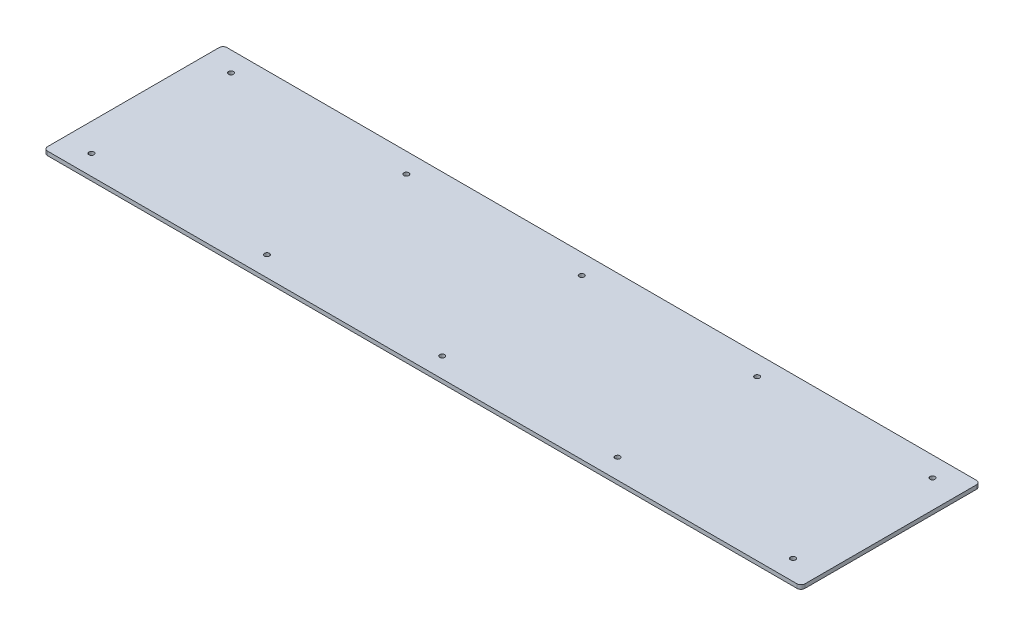
ISO-10303-21;
HEADER;
FILE_DESCRIPTION(('STEP AP214'),'2;1');
FILE_NAME('part.step','',(''),(''),'','','');
FILE_SCHEMA(('AUTOMOTIVE_DESIGN { 1 0 10303 214 1 1 1 1 }'));
ENDSEC;
DATA;
#1=APPLICATION_CONTEXT('core data for automotive mechanical design processes');
#2=APPLICATION_PROTOCOL_DEFINITION('international standard','automotive_design',2000,#1);
#3=PRODUCT_CONTEXT('',#1,'mechanical');
#4=PRODUCT('Part','Part','',(#3));
#5=PRODUCT_RELATED_PRODUCT_CATEGORY('part','',(#4));
#6=PRODUCT_DEFINITION_FORMATION('','',#4);
#7=PRODUCT_DEFINITION_CONTEXT('part definition',#1,'design');
#8=PRODUCT_DEFINITION('design','',#6,#7);
#9=PRODUCT_DEFINITION_SHAPE('','',#8);
#10=(LENGTH_UNIT() NAMED_UNIT(*) SI_UNIT(.MILLI.,.METRE.));
#11=(NAMED_UNIT(*) PLANE_ANGLE_UNIT() SI_UNIT($,.RADIAN.));
#12=(NAMED_UNIT(*) SI_UNIT($,.STERADIAN.) SOLID_ANGLE_UNIT());
#13=UNCERTAINTY_MEASURE_WITH_UNIT(LENGTH_MEASURE(1.E-05),#10,'distance_accuracy_value','');
#14=(GEOMETRIC_REPRESENTATION_CONTEXT(3) GLOBAL_UNCERTAINTY_ASSIGNED_CONTEXT((#13)) GLOBAL_UNIT_ASSIGNED_CONTEXT((#10,
#11,#12)) REPRESENTATION_CONTEXT('',''));
#15=CARTESIAN_POINT('',(0.,0.,0.));
#16=DIRECTION('',(0.,0.,1.));
#17=DIRECTION('',(1.,0.,0.));
#18=AXIS2_PLACEMENT_3D('',#15,#16,#17);
#19=CARTESIAN_POINT('',(1162.05,6.35,-254.));
#20=DIRECTION('',(0.,1.,0.));
#21=DIRECTION('',(0.,0.,1.));
#22=AXIS2_PLACEMENT_3D('',#19,#20,#21);
#23=CYLINDRICAL_SURFACE('',#22,3.96875);
#24=CARTESIAN_POINT('',(1162.05,0.,-254.));
#25=DIRECTION('',(0.,1.,0.));
#26=DIRECTION('',(0.,0.,1.));
#27=AXIS2_PLACEMENT_3D('',#24,#25,#26);
#28=CIRCLE('',#27,3.96875);
#29=CARTESIAN_POINT('',(1162.05,0.,-250.03125));
#30=VERTEX_POINT('',#29);
#31=EDGE_CURVE('E176',#30,#30,#28,.T.);
#32=ORIENTED_EDGE('',*,*,#31,.F.);
#33=EDGE_LOOP('',(#32));
#34=FACE_BOUND('',#33,.T.);
#35=CARTESIAN_POINT('',(1162.05,6.35,-254.));
#36=DIRECTION('',(0.,1.,0.));
#37=DIRECTION('',(0.,0.,1.));
#38=AXIS2_PLACEMENT_3D('',#35,#36,#37);
#39=CIRCLE('',#38,3.96875);
#40=CARTESIAN_POINT('',(1162.05,6.35,-250.03125));
#41=VERTEX_POINT('',#40);
#42=EDGE_CURVE('E179',#41,#41,#39,.T.);
#43=ORIENTED_EDGE('',*,*,#42,.T.);
#44=EDGE_LOOP('',(#43));
#45=FACE_BOUND('',#44,.T.);
#46=ADVANCED_FACE('F32',(#34,#45),#23,.F.);
#47=CARTESIAN_POINT('',(882.65,6.35,-254.));
#48=DIRECTION('',(0.,1.,0.));
#49=DIRECTION('',(0.,0.,1.));
#50=AXIS2_PLACEMENT_3D('',#47,#48,#49);
#51=CYLINDRICAL_SURFACE('',#50,3.96875);
#52=CARTESIAN_POINT('',(882.65,0.,-254.));
#53=DIRECTION('',(0.,1.,0.));
#54=DIRECTION('',(0.,0.,1.));
#55=AXIS2_PLACEMENT_3D('',#52,#53,#54);
#56=CIRCLE('',#55,3.96875);
#57=CARTESIAN_POINT('',(882.65,0.,-250.03125));
#58=VERTEX_POINT('',#57);
#59=EDGE_CURVE('E170',#58,#58,#56,.T.);
#60=ORIENTED_EDGE('',*,*,#59,.F.);
#61=EDGE_LOOP('',(#60));
#62=FACE_BOUND('',#61,.T.);
#63=CARTESIAN_POINT('',(882.65,6.35,-254.));
#64=DIRECTION('',(0.,1.,0.));
#65=DIRECTION('',(0.,0.,1.));
#66=AXIS2_PLACEMENT_3D('',#63,#64,#65);
#67=CIRCLE('',#66,3.96875);
#68=CARTESIAN_POINT('',(882.65,6.35,-250.03125));
#69=VERTEX_POINT('',#68);
#70=EDGE_CURVE('E173',#69,#69,#67,.T.);
#71=ORIENTED_EDGE('',*,*,#70,.T.);
#72=EDGE_LOOP('',(#71));
#73=FACE_BOUND('',#72,.T.);
#74=ADVANCED_FACE('F264',(#62,#73),#51,.F.);
#75=CARTESIAN_POINT('',(603.25,6.35,-254.));
#76=DIRECTION('',(0.,1.,0.));
#77=DIRECTION('',(0.,0.,1.));
#78=AXIS2_PLACEMENT_3D('',#75,#76,#77);
#79=CYLINDRICAL_SURFACE('',#78,3.96875);
#80=CARTESIAN_POINT('',(603.25,0.,-254.));
#81=DIRECTION('',(0.,1.,0.));
#82=DIRECTION('',(0.,0.,1.));
#83=AXIS2_PLACEMENT_3D('',#80,#81,#82);
#84=CIRCLE('',#83,3.96875);
#85=CARTESIAN_POINT('',(603.25,0.,-250.03125));
#86=VERTEX_POINT('',#85);
#87=EDGE_CURVE('E164',#86,#86,#84,.T.);
#88=ORIENTED_EDGE('',*,*,#87,.F.);
#89=EDGE_LOOP('',(#88));
#90=FACE_BOUND('',#89,.T.);
#91=CARTESIAN_POINT('',(603.25,6.35,-254.));
#92=DIRECTION('',(0.,1.,0.));
#93=DIRECTION('',(0.,0.,1.));
#94=AXIS2_PLACEMENT_3D('',#91,#92,#93);
#95=CIRCLE('',#94,3.96875);
#96=CARTESIAN_POINT('',(603.25,6.35,-250.03125));
#97=VERTEX_POINT('',#96);
#98=EDGE_CURVE('E167',#97,#97,#95,.T.);
#99=ORIENTED_EDGE('',*,*,#98,.T.);
#100=EDGE_LOOP('',(#99));
#101=FACE_BOUND('',#100,.T.);
#102=ADVANCED_FACE('F270',(#90,#101),#79,.F.);
#103=CARTESIAN_POINT('',(323.85,6.35,-254.));
#104=DIRECTION('',(0.,1.,0.));
#105=DIRECTION('',(0.,0.,1.));
#106=AXIS2_PLACEMENT_3D('',#103,#104,#105);
#107=CYLINDRICAL_SURFACE('',#106,3.96875);
#108=CARTESIAN_POINT('',(323.85,0.,-254.));
#109=DIRECTION('',(0.,1.,0.));
#110=DIRECTION('',(0.,0.,1.));
#111=AXIS2_PLACEMENT_3D('',#108,#109,#110);
#112=CIRCLE('',#111,3.96875);
#113=CARTESIAN_POINT('',(323.85,0.,-250.03125));
#114=VERTEX_POINT('',#113);
#115=EDGE_CURVE('E158',#114,#114,#112,.T.);
#116=ORIENTED_EDGE('',*,*,#115,.F.);
#117=EDGE_LOOP('',(#116));
#118=FACE_BOUND('',#117,.T.);
#119=CARTESIAN_POINT('',(323.85,6.35,-254.));
#120=DIRECTION('',(0.,1.,0.));
#121=DIRECTION('',(0.,0.,1.));
#122=AXIS2_PLACEMENT_3D('',#119,#120,#121);
#123=CIRCLE('',#122,3.96875);
#124=CARTESIAN_POINT('',(323.85,6.35,-250.03125));
#125=VERTEX_POINT('',#124);
#126=EDGE_CURVE('E161',#125,#125,#123,.T.);
#127=ORIENTED_EDGE('',*,*,#126,.T.);
#128=EDGE_LOOP('',(#127));
#129=FACE_BOUND('',#128,.T.);
#130=ADVANCED_FACE('F320',(#118,#129),#107,.F.);
#131=CARTESIAN_POINT('',(44.45,6.35,-254.));
#132=DIRECTION('',(0.,1.,0.));
#133=DIRECTION('',(0.,0.,1.));
#134=AXIS2_PLACEMENT_3D('',#131,#132,#133);
#135=CYLINDRICAL_SURFACE('',#134,3.96875);
#136=CARTESIAN_POINT('',(44.45,0.,-254.));
#137=DIRECTION('',(0.,1.,0.));
#138=DIRECTION('',(0.,0.,1.));
#139=AXIS2_PLACEMENT_3D('',#136,#137,#138);
#140=CIRCLE('',#139,3.96875);
#141=CARTESIAN_POINT('',(44.45,0.,-250.03125));
#142=VERTEX_POINT('',#141);
#143=EDGE_CURVE('E152',#142,#142,#140,.T.);
#144=ORIENTED_EDGE('',*,*,#143,.F.);
#145=EDGE_LOOP('',(#144));
#146=FACE_BOUND('',#145,.T.);
#147=CARTESIAN_POINT('',(44.45,6.35,-254.));
#148=DIRECTION('',(0.,1.,0.));
#149=DIRECTION('',(0.,0.,1.));
#150=AXIS2_PLACEMENT_3D('',#147,#148,#149);
#151=CIRCLE('',#150,3.96875);
#152=CARTESIAN_POINT('',(44.45,6.35,-250.03125));
#153=VERTEX_POINT('',#152);
#154=EDGE_CURVE('E155',#153,#153,#151,.T.);
#155=ORIENTED_EDGE('',*,*,#154,.T.);
#156=EDGE_LOOP('',(#155));
#157=FACE_BOUND('',#156,.T.);
#158=ADVANCED_FACE('F316',(#146,#157),#135,.F.);
#159=CARTESIAN_POINT('',(1162.05,6.35,-31.75));
#160=DIRECTION('',(0.,1.,0.));
#161=DIRECTION('',(0.,0.,1.));
#162=AXIS2_PLACEMENT_3D('',#159,#160,#161);
#163=CYLINDRICAL_SURFACE('',#162,3.96875);
#164=CARTESIAN_POINT('',(1162.05,0.,-31.75));
#165=DIRECTION('',(0.,1.,0.));
#166=DIRECTION('',(0.,0.,1.));
#167=AXIS2_PLACEMENT_3D('',#164,#165,#166);
#168=CIRCLE('',#167,3.96875);
#169=CARTESIAN_POINT('',(1162.05,0.,-27.78125));
#170=VERTEX_POINT('',#169);
#171=EDGE_CURVE('E146',#170,#170,#168,.T.);
#172=ORIENTED_EDGE('',*,*,#171,.F.);
#173=EDGE_LOOP('',(#172));
#174=FACE_BOUND('',#173,.T.);
#175=CARTESIAN_POINT('',(1162.05,6.35,-31.75));
#176=DIRECTION('',(0.,1.,0.));
#177=DIRECTION('',(0.,0.,1.));
#178=AXIS2_PLACEMENT_3D('',#175,#176,#177);
#179=CIRCLE('',#178,3.96875);
#180=CARTESIAN_POINT('',(1162.05,6.35,-27.78125));
#181=VERTEX_POINT('',#180);
#182=EDGE_CURVE('E149',#181,#181,#179,.T.);
#183=ORIENTED_EDGE('',*,*,#182,.T.);
#184=EDGE_LOOP('',(#183));
#185=FACE_BOUND('',#184,.T.);
#186=ADVANCED_FACE('F312',(#174,#185),#163,.F.);
#187=CARTESIAN_POINT('',(882.65,6.35,-31.75));
#188=DIRECTION('',(0.,1.,0.));
#189=DIRECTION('',(0.,0.,1.));
#190=AXIS2_PLACEMENT_3D('',#187,#188,#189);
#191=CYLINDRICAL_SURFACE('',#190,3.96875);
#192=CARTESIAN_POINT('',(882.65,0.,-31.75));
#193=DIRECTION('',(0.,1.,0.));
#194=DIRECTION('',(0.,0.,1.));
#195=AXIS2_PLACEMENT_3D('',#192,#193,#194);
#196=CIRCLE('',#195,3.96875);
#197=CARTESIAN_POINT('',(882.65,0.,-27.78125));
#198=VERTEX_POINT('',#197);
#199=EDGE_CURVE('E140',#198,#198,#196,.T.);
#200=ORIENTED_EDGE('',*,*,#199,.F.);
#201=EDGE_LOOP('',(#200));
#202=FACE_BOUND('',#201,.T.);
#203=CARTESIAN_POINT('',(882.65,6.35,-31.75));
#204=DIRECTION('',(0.,1.,0.));
#205=DIRECTION('',(0.,0.,1.));
#206=AXIS2_PLACEMENT_3D('',#203,#204,#205);
#207=CIRCLE('',#206,3.96875);
#208=CARTESIAN_POINT('',(882.65,6.35,-27.78125));
#209=VERTEX_POINT('',#208);
#210=EDGE_CURVE('E143',#209,#209,#207,.T.);
#211=ORIENTED_EDGE('',*,*,#210,.T.);
#212=EDGE_LOOP('',(#211));
#213=FACE_BOUND('',#212,.T.);
#214=ADVANCED_FACE('F308',(#202,#213),#191,.F.);
#215=CARTESIAN_POINT('',(603.25,6.35,-31.75));
#216=DIRECTION('',(0.,1.,0.));
#217=DIRECTION('',(0.,0.,1.));
#218=AXIS2_PLACEMENT_3D('',#215,#216,#217);
#219=CYLINDRICAL_SURFACE('',#218,3.96875);
#220=CARTESIAN_POINT('',(603.25,0.,-31.75));
#221=DIRECTION('',(0.,1.,0.));
#222=DIRECTION('',(0.,0.,1.));
#223=AXIS2_PLACEMENT_3D('',#220,#221,#222);
#224=CIRCLE('',#223,3.96875);
#225=CARTESIAN_POINT('',(603.25,0.,-27.78125));
#226=VERTEX_POINT('',#225);
#227=EDGE_CURVE('E134',#226,#226,#224,.T.);
#228=ORIENTED_EDGE('',*,*,#227,.F.);
#229=EDGE_LOOP('',(#228));
#230=FACE_BOUND('',#229,.T.);
#231=CARTESIAN_POINT('',(603.25,6.35,-31.75));
#232=DIRECTION('',(0.,1.,0.));
#233=DIRECTION('',(0.,0.,1.));
#234=AXIS2_PLACEMENT_3D('',#231,#232,#233);
#235=CIRCLE('',#234,3.96875);
#236=CARTESIAN_POINT('',(603.25,6.35,-27.78125));
#237=VERTEX_POINT('',#236);
#238=EDGE_CURVE('E137',#237,#237,#235,.T.);
#239=ORIENTED_EDGE('',*,*,#238,.T.);
#240=EDGE_LOOP('',(#239));
#241=FACE_BOUND('',#240,.T.);
#242=ADVANCED_FACE('F305',(#230,#241),#219,.F.);
#243=CARTESIAN_POINT('',(0.,6.35,0.));
#244=DIRECTION('',(1.,0.,0.));
#245=DIRECTION('',(0.,0.,-1.));
#246=AXIS2_PLACEMENT_3D('',#243,#244,#245);
#247=PLANE('',#246);
#248=DIRECTION('',(0.,0.,1.));
#249=VECTOR('',#248,1.);
#250=CARTESIAN_POINT('',(0.,0.,0.));
#251=LINE('',#250,#249);
#252=CARTESIAN_POINT('',(0.,0.,-279.4));
#253=VERTEX_POINT('',#252);
#254=CARTESIAN_POINT('',(0.,0.,-6.35));
#255=VERTEX_POINT('',#254);
#256=EDGE_CURVE('E206',#253,#255,#251,.T.);
#257=ORIENTED_EDGE('',*,*,#256,.T.);
#258=DIRECTION('',(0.,-1.,0.));
#259=VECTOR('',#258,1.);
#260=CARTESIAN_POINT('',(0.,6.35,-6.35));
#261=LINE('',#260,#259);
#262=CARTESIAN_POINT('',(0.,6.35,-6.35));
#263=VERTEX_POINT('',#262);
#264=EDGE_CURVE('E11',#255,#263,#261,.F.);
#265=ORIENTED_EDGE('',*,*,#264,.T.);
#266=DIRECTION('',(0.,0.,1.));
#267=VECTOR('',#266,1.);
#268=CARTESIAN_POINT('',(0.,6.35,0.));
#269=LINE('',#268,#267);
#270=CARTESIAN_POINT('',(0.,6.35,-279.4));
#271=VERTEX_POINT('',#270);
#272=EDGE_CURVE('E125',#271,#263,#269,.T.);
#273=ORIENTED_EDGE('',*,*,#272,.F.);
#274=DIRECTION('',(0.,-1.,0.));
#275=VECTOR('',#274,1.);
#276=CARTESIAN_POINT('',(0.,6.35,-279.4));
#277=LINE('',#276,#275);
#278=EDGE_CURVE('E40',#271,#253,#277,.T.);
#279=ORIENTED_EDGE('',*,*,#278,.T.);
#280=EDGE_LOOP('',(#257,#265,#273,#279));
#281=FACE_BOUND('',#280,.T.);
#282=ADVANCED_FACE('F205',(#281),#247,.F.);
#283=CARTESIAN_POINT('',(0.,6.35,0.));
#284=DIRECTION('',(0.,0.,-1.));
#285=DIRECTION('',(-1.,0.,0.));
#286=AXIS2_PLACEMENT_3D('',#283,#284,#285);
#287=PLANE('',#286);
#288=DIRECTION('',(1.,0.,0.));
#289=VECTOR('',#288,1.);
#290=CARTESIAN_POINT('',(0.,0.,0.));
#291=LINE('',#290,#289);
#292=CARTESIAN_POINT('',(6.35,0.,0.));
#293=VERTEX_POINT('',#292);
#294=CARTESIAN_POINT('',(1200.15,0.,0.));
#295=VERTEX_POINT('',#294);
#296=EDGE_CURVE('E130',#293,#295,#291,.T.);
#297=ORIENTED_EDGE('',*,*,#296,.T.);
#298=DIRECTION('',(0.,-1.,0.));
#299=VECTOR('',#298,1.);
#300=CARTESIAN_POINT('',(1200.15,6.35,0.));
#301=LINE('',#300,#299);
#302=CARTESIAN_POINT('',(1200.15,6.35,0.));
#303=VERTEX_POINT('',#302);
#304=EDGE_CURVE('E47',#295,#303,#301,.F.);
#305=ORIENTED_EDGE('',*,*,#304,.T.);
#306=DIRECTION('',(1.,0.,0.));
#307=VECTOR('',#306,1.);
#308=CARTESIAN_POINT('',(0.,6.35,0.));
#309=LINE('',#308,#307);
#310=CARTESIAN_POINT('',(6.35,6.35,0.));
#311=VERTEX_POINT('',#310);
#312=EDGE_CURVE('E128',#311,#303,#309,.T.);
#313=ORIENTED_EDGE('',*,*,#312,.F.);
#314=DIRECTION('',(0.,-1.,0.));
#315=VECTOR('',#314,1.);
#316=CARTESIAN_POINT('',(6.35,6.35,0.));
#317=LINE('',#316,#315);
#318=EDGE_CURVE('E197',#311,#293,#317,.T.);
#319=ORIENTED_EDGE('',*,*,#318,.T.);
#320=EDGE_LOOP('',(#297,#305,#313,#319));
#321=FACE_BOUND('',#320,.T.);
#322=ADVANCED_FACE('F288',(#321),#287,.F.);
#323=CARTESIAN_POINT('',(1206.5,6.35,0.));
#324=DIRECTION('',(-1.,0.,0.));
#325=DIRECTION('',(0.,0.,1.));
#326=AXIS2_PLACEMENT_3D('',#323,#324,#325);
#327=PLANE('',#326);
#328=DIRECTION('',(0.,0.,-1.));
#329=VECTOR('',#328,1.);
#330=CARTESIAN_POINT('',(1206.5,0.,0.));
#331=LINE('',#330,#329);
#332=CARTESIAN_POINT('',(1206.5,0.,-6.35));
#333=VERTEX_POINT('',#332);
#334=CARTESIAN_POINT('',(1206.5,0.,-279.4));
#335=VERTEX_POINT('',#334);
#336=EDGE_CURVE('E126',#333,#335,#331,.T.);
#337=ORIENTED_EDGE('',*,*,#336,.T.);
#338=DIRECTION('',(0.,-1.,0.));
#339=VECTOR('',#338,1.);
#340=CARTESIAN_POINT('',(1206.5,6.35,-279.4));
#341=LINE('',#340,#339);
#342=CARTESIAN_POINT('',(1206.5,6.35,-279.4));
#343=VERTEX_POINT('',#342);
#344=EDGE_CURVE('E103',#335,#343,#341,.F.);
#345=ORIENTED_EDGE('',*,*,#344,.T.);
#346=DIRECTION('',(0.,0.,-1.));
#347=VECTOR('',#346,1.);
#348=CARTESIAN_POINT('',(1206.5,6.35,0.));
#349=LINE('',#348,#347);
#350=CARTESIAN_POINT('',(1206.5,6.35,-6.35));
#351=VERTEX_POINT('',#350);
#352=EDGE_CURVE('E218',#351,#343,#349,.T.);
#353=ORIENTED_EDGE('',*,*,#352,.F.);
#354=DIRECTION('',(0.,-1.,0.));
#355=VECTOR('',#354,1.);
#356=CARTESIAN_POINT('',(1206.5,6.35,-6.35));
#357=LINE('',#356,#355);
#358=EDGE_CURVE('E108',#351,#333,#357,.T.);
#359=ORIENTED_EDGE('',*,*,#358,.T.);
#360=EDGE_LOOP('',(#337,#345,#353,#359));
#361=FACE_BOUND('',#360,.T.);
#362=ADVANCED_FACE('F292',(#361),#327,.F.);
#363=CARTESIAN_POINT('',(0.,6.35,-285.75));
#364=DIRECTION('',(0.,0.,1.));
#365=DIRECTION('',(1.,0.,0.));
#366=AXIS2_PLACEMENT_3D('',#363,#364,#365);
#367=PLANE('',#366);
#368=DIRECTION('',(-1.,0.,0.));
#369=VECTOR('',#368,1.);
#370=CARTESIAN_POINT('',(0.,6.35,-285.75));
#371=LINE('',#370,#369);
#372=CARTESIAN_POINT('',(1200.15,6.35,-285.75));
#373=VERTEX_POINT('',#372);
#374=CARTESIAN_POINT('',(6.35,6.35,-285.75));
#375=VERTEX_POINT('',#374);
#376=EDGE_CURVE('E118',#373,#375,#371,.T.);
#377=ORIENTED_EDGE('',*,*,#376,.F.);
#378=DIRECTION('',(0.,-1.,0.));
#379=VECTOR('',#378,1.);
#380=CARTESIAN_POINT('',(1200.15,6.35,-285.75));
#381=LINE('',#380,#379);
#382=CARTESIAN_POINT('',(1200.15,0.,-285.75));
#383=VERTEX_POINT('',#382);
#384=EDGE_CURVE('E102',#373,#383,#381,.T.);
#385=ORIENTED_EDGE('',*,*,#384,.T.);
#386=DIRECTION('',(-1.,0.,0.));
#387=VECTOR('',#386,1.);
#388=CARTESIAN_POINT('',(0.,0.,-285.75));
#389=LINE('',#388,#387);
#390=CARTESIAN_POINT('',(6.35,0.,-285.75));
#391=VERTEX_POINT('',#390);
#392=EDGE_CURVE('E115',#383,#391,#389,.T.);
#393=ORIENTED_EDGE('',*,*,#392,.T.);
#394=DIRECTION('',(0.,-1.,0.));
#395=VECTOR('',#394,1.);
#396=CARTESIAN_POINT('',(6.35,6.35,-285.75));
#397=LINE('',#396,#395);
#398=EDGE_CURVE('E120',#391,#375,#397,.F.);
#399=ORIENTED_EDGE('',*,*,#398,.T.);
#400=EDGE_LOOP('',(#377,#385,#393,#399));
#401=FACE_BOUND('',#400,.T.);
#402=ADVANCED_FACE('F114',(#401),#367,.F.);
#403=CARTESIAN_POINT('',(0.,6.35,0.));
#404=DIRECTION('',(0.,-1.,0.));
#405=DIRECTION('',(0.,0.,-1.));
#406=AXIS2_PLACEMENT_3D('',#403,#404,#405);
#407=PLANE('',#406);
#408=CARTESIAN_POINT('',(323.85,6.35,-31.75));
#409=DIRECTION('',(0.,1.,0.));
#410=DIRECTION('',(0.,0.,1.));
#411=AXIS2_PLACEMENT_3D('',#408,#409,#410);
#412=CIRCLE('',#411,3.96875);
#413=CARTESIAN_POINT('',(323.85,6.35,-27.78125));
#414=VERTEX_POINT('',#413);
#415=EDGE_CURVE('E224',#414,#414,#412,.T.);
#416=ORIENTED_EDGE('',*,*,#415,.F.);
#417=EDGE_LOOP('',(#416));
#418=FACE_BOUND('',#417,.T.);
#419=CARTESIAN_POINT('',(44.45,6.35,-31.75));
#420=DIRECTION('',(0.,1.,0.));
#421=DIRECTION('',(0.,0.,1.));
#422=AXIS2_PLACEMENT_3D('',#419,#420,#421);
#423=CIRCLE('',#422,3.96875);
#424=CARTESIAN_POINT('',(44.45,6.35,-27.78125));
#425=VERTEX_POINT('',#424);
#426=EDGE_CURVE('E214',#425,#425,#423,.T.);
#427=ORIENTED_EDGE('',*,*,#426,.F.);
#428=EDGE_LOOP('',(#427));
#429=FACE_BOUND('',#428,.T.);
#430=ORIENTED_EDGE('',*,*,#352,.T.);
#431=CARTESIAN_POINT('',(1200.15,6.35,-279.4));
#432=DIRECTION('',(0.,-1.,0.));
#433=DIRECTION('',(0.,0.,-1.));
#434=AXIS2_PLACEMENT_3D('',#431,#432,#433);
#435=CIRCLE('',#434,6.35);
#436=EDGE_CURVE('E195',#343,#373,#435,.F.);
#437=ORIENTED_EDGE('',*,*,#436,.T.);
#438=ORIENTED_EDGE('',*,*,#376,.T.);
#439=CARTESIAN_POINT('',(6.35,6.35,-279.4));
#440=DIRECTION('',(0.,-1.,0.));
#441=DIRECTION('',(0.,0.,-1.));
#442=AXIS2_PLACEMENT_3D('',#439,#440,#441);
#443=CIRCLE('',#442,6.35);
#444=EDGE_CURVE('E190',#375,#271,#443,.F.);
#445=ORIENTED_EDGE('',*,*,#444,.T.);
#446=ORIENTED_EDGE('',*,*,#272,.T.);
#447=CARTESIAN_POINT('',(6.35,6.35,-6.35));
#448=DIRECTION('',(0.,-1.,0.));
#449=DIRECTION('',(0.,0.,-1.));
#450=AXIS2_PLACEMENT_3D('',#447,#448,#449);
#451=CIRCLE('',#450,6.35);
#452=EDGE_CURVE('E54',#263,#311,#451,.F.);
#453=ORIENTED_EDGE('',*,*,#452,.T.);
#454=ORIENTED_EDGE('',*,*,#312,.T.);
#455=CARTESIAN_POINT('',(1200.15,6.35,-6.35));
#456=DIRECTION('',(0.,-1.,0.));
#457=DIRECTION('',(0.,0.,-1.));
#458=AXIS2_PLACEMENT_3D('',#455,#456,#457);
#459=CIRCLE('',#458,6.35);
#460=EDGE_CURVE('E193',#303,#351,#459,.F.);
#461=ORIENTED_EDGE('',*,*,#460,.T.);
#462=EDGE_LOOP('',(#430,#437,#438,#445,#446,#453,#454,#461));
#463=FACE_BOUND('',#462,.T.);
#464=ORIENTED_EDGE('',*,*,#238,.F.);
#465=EDGE_LOOP('',(#464));
#466=FACE_BOUND('',#465,.T.);
#467=ORIENTED_EDGE('',*,*,#210,.F.);
#468=EDGE_LOOP('',(#467));
#469=FACE_BOUND('',#468,.T.);
#470=ORIENTED_EDGE('',*,*,#182,.F.);
#471=EDGE_LOOP('',(#470));
#472=FACE_BOUND('',#471,.T.);
#473=ORIENTED_EDGE('',*,*,#154,.F.);
#474=EDGE_LOOP('',(#473));
#475=FACE_BOUND('',#474,.T.);
#476=ORIENTED_EDGE('',*,*,#126,.F.);
#477=EDGE_LOOP('',(#476));
#478=FACE_BOUND('',#477,.T.);
#479=ORIENTED_EDGE('',*,*,#98,.F.);
#480=EDGE_LOOP('',(#479));
#481=FACE_BOUND('',#480,.T.);
#482=ORIENTED_EDGE('',*,*,#70,.F.);
#483=EDGE_LOOP('',(#482));
#484=FACE_BOUND('',#483,.T.);
#485=ORIENTED_EDGE('',*,*,#42,.F.);
#486=EDGE_LOOP('',(#485));
#487=FACE_BOUND('',#486,.T.);
#488=ADVANCED_FACE('F240',(#418,#429,#463,#466,#469,#472,#475,#478,#481,#484,#487),#407,.F.);
#489=CARTESIAN_POINT('',(0.,0.,0.));
#490=DIRECTION('',(0.,-1.,0.));
#491=DIRECTION('',(0.,0.,-1.));
#492=AXIS2_PLACEMENT_3D('',#489,#490,#491);
#493=PLANE('',#492);
#494=CARTESIAN_POINT('',(323.85,0.,-31.75));
#495=DIRECTION('',(0.,1.,0.));
#496=DIRECTION('',(0.,0.,1.));
#497=AXIS2_PLACEMENT_3D('',#494,#495,#496);
#498=CIRCLE('',#497,3.96875);
#499=CARTESIAN_POINT('',(323.85,0.,-27.78125));
#500=VERTEX_POINT('',#499);
#501=EDGE_CURVE('E227',#500,#500,#498,.T.);
#502=ORIENTED_EDGE('',*,*,#501,.T.);
#503=EDGE_LOOP('',(#502));
#504=FACE_BOUND('',#503,.T.);
#505=CARTESIAN_POINT('',(44.45,0.,-31.75));
#506=DIRECTION('',(0.,1.,0.));
#507=DIRECTION('',(0.,0.,1.));
#508=AXIS2_PLACEMENT_3D('',#505,#506,#507);
#509=CIRCLE('',#508,3.96875);
#510=CARTESIAN_POINT('',(44.45,0.,-27.78125));
#511=VERTEX_POINT('',#510);
#512=EDGE_CURVE('E211',#511,#511,#509,.T.);
#513=ORIENTED_EDGE('',*,*,#512,.T.);
#514=EDGE_LOOP('',(#513));
#515=FACE_BOUND('',#514,.T.);
#516=ORIENTED_EDGE('',*,*,#392,.F.);
#517=CARTESIAN_POINT('',(1200.15,0.,-279.4));
#518=DIRECTION('',(0.,-1.,0.));
#519=DIRECTION('',(0.,0.,-1.));
#520=AXIS2_PLACEMENT_3D('',#517,#518,#519);
#521=CIRCLE('',#520,6.35);
#522=EDGE_CURVE('E98',#383,#335,#521,.T.);
#523=ORIENTED_EDGE('',*,*,#522,.T.);
#524=ORIENTED_EDGE('',*,*,#336,.F.);
#525=CARTESIAN_POINT('',(1200.15,0.,-6.35));
#526=DIRECTION('',(0.,-1.,0.));
#527=DIRECTION('',(0.,0.,-1.));
#528=AXIS2_PLACEMENT_3D('',#525,#526,#527);
#529=CIRCLE('',#528,6.35);
#530=EDGE_CURVE('E109',#333,#295,#529,.T.);
#531=ORIENTED_EDGE('',*,*,#530,.T.);
#532=ORIENTED_EDGE('',*,*,#296,.F.);
#533=CARTESIAN_POINT('',(6.35,0.,-6.35));
#534=DIRECTION('',(0.,-1.,0.));
#535=DIRECTION('',(0.,0.,-1.));
#536=AXIS2_PLACEMENT_3D('',#533,#534,#535);
#537=CIRCLE('',#536,6.35);
#538=EDGE_CURVE('E184',#293,#255,#537,.T.);
#539=ORIENTED_EDGE('',*,*,#538,.T.);
#540=ORIENTED_EDGE('',*,*,#256,.F.);
#541=CARTESIAN_POINT('',(6.35,0.,-279.4));
#542=DIRECTION('',(0.,-1.,0.));
#543=DIRECTION('',(0.,0.,-1.));
#544=AXIS2_PLACEMENT_3D('',#541,#542,#543);
#545=CIRCLE('',#544,6.35);
#546=EDGE_CURVE('E119',#253,#391,#545,.T.);
#547=ORIENTED_EDGE('',*,*,#546,.T.);
#548=EDGE_LOOP('',(#516,#523,#524,#531,#532,#539,#540,#547));
#549=FACE_BOUND('',#548,.T.);
#550=ORIENTED_EDGE('',*,*,#227,.T.);
#551=EDGE_LOOP('',(#550));
#552=FACE_BOUND('',#551,.T.);
#553=ORIENTED_EDGE('',*,*,#199,.T.);
#554=EDGE_LOOP('',(#553));
#555=FACE_BOUND('',#554,.T.);
#556=ORIENTED_EDGE('',*,*,#171,.T.);
#557=EDGE_LOOP('',(#556));
#558=FACE_BOUND('',#557,.T.);
#559=ORIENTED_EDGE('',*,*,#143,.T.);
#560=EDGE_LOOP('',(#559));
#561=FACE_BOUND('',#560,.T.);
#562=ORIENTED_EDGE('',*,*,#115,.T.);
#563=EDGE_LOOP('',(#562));
#564=FACE_BOUND('',#563,.T.);
#565=ORIENTED_EDGE('',*,*,#87,.T.);
#566=EDGE_LOOP('',(#565));
#567=FACE_BOUND('',#566,.T.);
#568=ORIENTED_EDGE('',*,*,#59,.T.);
#569=EDGE_LOOP('',(#568));
#570=FACE_BOUND('',#569,.T.);
#571=ORIENTED_EDGE('',*,*,#31,.T.);
#572=EDGE_LOOP('',(#571));
#573=FACE_BOUND('',#572,.T.);
#574=ADVANCED_FACE('F122',(#504,#515,#549,#552,#555,#558,#561,#564,#567,#570,#573),#493,.T.);
#575=CARTESIAN_POINT('',(44.45,6.35,-31.75));
#576=DIRECTION('',(0.,1.,0.));
#577=DIRECTION('',(0.,0.,1.));
#578=AXIS2_PLACEMENT_3D('',#575,#576,#577);
#579=CYLINDRICAL_SURFACE('',#578,3.96875);
#580=ORIENTED_EDGE('',*,*,#512,.F.);
#581=EDGE_LOOP('',(#580));
#582=FACE_BOUND('',#581,.T.);
#583=ORIENTED_EDGE('',*,*,#426,.T.);
#584=EDGE_LOOP('',(#583));
#585=FACE_BOUND('',#584,.T.);
#586=ADVANCED_FACE('F236',(#582,#585),#579,.F.);
#587=CARTESIAN_POINT('',(323.85,6.35,-31.75));
#588=DIRECTION('',(0.,1.,0.));
#589=DIRECTION('',(0.,0.,1.));
#590=AXIS2_PLACEMENT_3D('',#587,#588,#589);
#591=CYLINDRICAL_SURFACE('',#590,3.96875);
#592=ORIENTED_EDGE('',*,*,#501,.F.);
#593=EDGE_LOOP('',(#592));
#594=FACE_BOUND('',#593,.T.);
#595=ORIENTED_EDGE('',*,*,#415,.T.);
#596=EDGE_LOOP('',(#595));
#597=FACE_BOUND('',#596,.T.);
#598=ADVANCED_FACE('F233',(#594,#597),#591,.F.);
#599=CARTESIAN_POINT('',(1200.15,6.35,-279.4));
#600=DIRECTION('',(0.,-1.,0.));
#601=DIRECTION('',(0.,0.,-1.));
#602=AXIS2_PLACEMENT_3D('',#599,#600,#601);
#603=CYLINDRICAL_SURFACE('',#602,6.35);
#604=ORIENTED_EDGE('',*,*,#436,.F.);
#605=ORIENTED_EDGE('',*,*,#344,.F.);
#606=ORIENTED_EDGE('',*,*,#522,.F.);
#607=ORIENTED_EDGE('',*,*,#384,.F.);
#608=EDGE_LOOP('',(#604,#605,#606,#607));
#609=FACE_BOUND('',#608,.T.);
#610=ADVANCED_FACE('F101',(#609),#603,.T.);
#611=CARTESIAN_POINT('',(1200.15,6.35,-6.35));
#612=DIRECTION('',(0.,-1.,0.));
#613=DIRECTION('',(0.,0.,-1.));
#614=AXIS2_PLACEMENT_3D('',#611,#612,#613);
#615=CYLINDRICAL_SURFACE('',#614,6.35);
#616=ORIENTED_EDGE('',*,*,#460,.F.);
#617=ORIENTED_EDGE('',*,*,#304,.F.);
#618=ORIENTED_EDGE('',*,*,#530,.F.);
#619=ORIENTED_EDGE('',*,*,#358,.F.);
#620=EDGE_LOOP('',(#616,#617,#618,#619));
#621=FACE_BOUND('',#620,.T.);
#622=ADVANCED_FACE('F278',(#621),#615,.T.);
#623=CARTESIAN_POINT('',(6.35,6.35,-6.35));
#624=DIRECTION('',(0.,-1.,0.));
#625=DIRECTION('',(0.,0.,-1.));
#626=AXIS2_PLACEMENT_3D('',#623,#624,#625);
#627=CYLINDRICAL_SURFACE('',#626,6.35);
#628=ORIENTED_EDGE('',*,*,#452,.F.);
#629=ORIENTED_EDGE('',*,*,#264,.F.);
#630=ORIENTED_EDGE('',*,*,#538,.F.);
#631=ORIENTED_EDGE('',*,*,#318,.F.);
#632=EDGE_LOOP('',(#628,#629,#630,#631));
#633=FACE_BOUND('',#632,.T.);
#634=ADVANCED_FACE('F280',(#633),#627,.T.);
#635=CARTESIAN_POINT('',(6.35,6.35,-279.4));
#636=DIRECTION('',(0.,-1.,0.));
#637=DIRECTION('',(0.,0.,-1.));
#638=AXIS2_PLACEMENT_3D('',#635,#636,#637);
#639=CYLINDRICAL_SURFACE('',#638,6.35);
#640=ORIENTED_EDGE('',*,*,#444,.F.);
#641=ORIENTED_EDGE('',*,*,#398,.F.);
#642=ORIENTED_EDGE('',*,*,#546,.F.);
#643=ORIENTED_EDGE('',*,*,#278,.F.);
#644=EDGE_LOOP('',(#640,#641,#642,#643));
#645=FACE_BOUND('',#644,.T.);
#646=ADVANCED_FACE('F34',(#645),#639,.T.);
#647=CLOSED_SHELL('',(#46,#74,#102,#130,#158,#186,#214,#242,#282,#322,#362,#402,#488,#574,#586,
#598,#610,#622,#634,#646));
#648=MANIFOLD_SOLID_BREP('B2',#647);
#649=ADVANCED_BREP_SHAPE_REPRESENTATION('',(#18,#648),#14);
#650=SHAPE_DEFINITION_REPRESENTATION(#9,#649);
ENDSEC;
END-ISO-10303-21;
